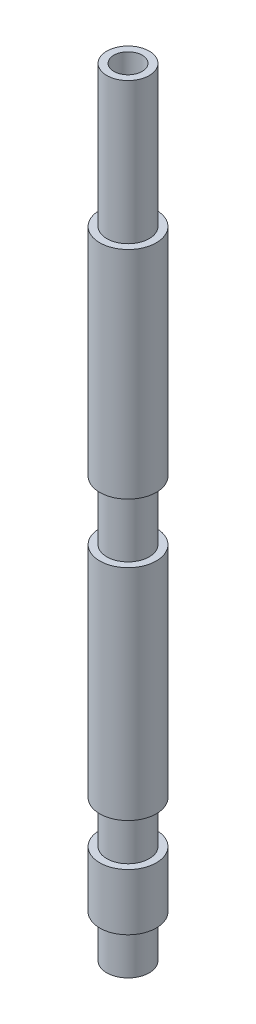
ISO-10303-21;
HEADER;
FILE_DESCRIPTION(('STEP AP214'),'2;1');
FILE_NAME('part.step','',(''),(''),'','','');
FILE_SCHEMA(('AUTOMOTIVE_DESIGN { 1 0 10303 214 1 1 1 1 }'));
ENDSEC;
DATA;
#1=APPLICATION_CONTEXT('core data for automotive mechanical design processes');
#2=APPLICATION_PROTOCOL_DEFINITION('international standard','automotive_design',2000,#1);
#3=PRODUCT_CONTEXT('',#1,'mechanical');
#4=PRODUCT('Part','Part','',(#3));
#5=PRODUCT_RELATED_PRODUCT_CATEGORY('part','',(#4));
#6=PRODUCT_DEFINITION_FORMATION('','',#4);
#7=PRODUCT_DEFINITION_CONTEXT('part definition',#1,'design');
#8=PRODUCT_DEFINITION('design','',#6,#7);
#9=PRODUCT_DEFINITION_SHAPE('','',#8);
#10=(LENGTH_UNIT() NAMED_UNIT(*) SI_UNIT(.MILLI.,.METRE.));
#11=(NAMED_UNIT(*) PLANE_ANGLE_UNIT() SI_UNIT($,.RADIAN.));
#12=(NAMED_UNIT(*) SI_UNIT($,.STERADIAN.) SOLID_ANGLE_UNIT());
#13=UNCERTAINTY_MEASURE_WITH_UNIT(LENGTH_MEASURE(1.E-05),#10,'distance_accuracy_value','');
#14=(GEOMETRIC_REPRESENTATION_CONTEXT(3) GLOBAL_UNCERTAINTY_ASSIGNED_CONTEXT((#13)) GLOBAL_UNIT_ASSIGNED_CONTEXT((#10,
#11,#12)) REPRESENTATION_CONTEXT('',''));
#15=CARTESIAN_POINT('',(0.,0.,0.));
#16=DIRECTION('',(0.,0.,1.));
#17=DIRECTION('',(1.,0.,0.));
#18=AXIS2_PLACEMENT_3D('',#15,#16,#17);
#19=CARTESIAN_POINT('',(0.,55.,0.));
#20=DIRECTION('',(0.,-1.,0.));
#21=DIRECTION('',(0.,0.,-1.));
#22=AXIS2_PLACEMENT_3D('',#19,#20,#21);
#23=CYLINDRICAL_SURFACE('',#22,2.);
#24=CARTESIAN_POINT('',(0.,45.,0.));
#25=DIRECTION('',(0.,-1.,0.));
#26=DIRECTION('',(0.,0.,-1.));
#27=AXIS2_PLACEMENT_3D('',#24,#25,#26);
#28=CIRCLE('',#27,2.);
#29=CARTESIAN_POINT('',(0.,45.,-2.));
#30=VERTEX_POINT('',#29);
#31=EDGE_CURVE('E66',#30,#30,#28,.T.);
#32=ORIENTED_EDGE('',*,*,#31,.T.);
#33=EDGE_LOOP('',(#32));
#34=FACE_BOUND('',#33,.T.);
#35=CARTESIAN_POINT('',(0.,29.7,0.));
#36=DIRECTION('',(0.,-1.,0.));
#37=DIRECTION('',(0.,0.,-1.));
#38=AXIS2_PLACEMENT_3D('',#35,#36,#37);
#39=CIRCLE('',#38,2.);
#40=CARTESIAN_POINT('',(0.,29.7,-2.));
#41=VERTEX_POINT('',#40);
#42=EDGE_CURVE('E75',#41,#41,#39,.T.);
#43=ORIENTED_EDGE('',*,*,#42,.F.);
#44=EDGE_LOOP('',(#43));
#45=FACE_BOUND('',#44,.T.);
#46=ADVANCED_FACE('F33',(#34,#45),#23,.T.);
#47=CARTESIAN_POINT('',(0.,10.,0.));
#48=DIRECTION('',(0.,-1.,0.));
#49=DIRECTION('',(0.,0.,-1.));
#50=AXIS2_PLACEMENT_3D('',#47,#48,#49);
#51=CIRCLE('',#50,2.);
#52=CARTESIAN_POINT('',(0.,10.,-2.));
#53=VERTEX_POINT('',#52);
#54=EDGE_CURVE('E54',#53,#53,#51,.T.);
#55=ORIENTED_EDGE('',*,*,#54,.F.);
#56=EDGE_LOOP('',(#55));
#57=FACE_BOUND('',#56,.T.);
#58=CARTESIAN_POINT('',(0.,25.5,0.));
#59=DIRECTION('',(0.,-1.,0.));
#60=DIRECTION('',(0.,0.,-1.));
#61=AXIS2_PLACEMENT_3D('',#58,#59,#60);
#62=CIRCLE('',#61,2.);
#63=CARTESIAN_POINT('',(0.,25.5,-2.));
#64=VERTEX_POINT('',#63);
#65=EDGE_CURVE('E84',#64,#64,#62,.T.);
#66=ORIENTED_EDGE('',*,*,#65,.T.);
#67=EDGE_LOOP('',(#66));
#68=FACE_BOUND('',#67,.T.);
#69=ADVANCED_FACE('F88',(#57,#68),#23,.T.);
#70=CARTESIAN_POINT('',(0.,55.,0.));
#71=DIRECTION('',(0.,1.,0.));
#72=DIRECTION('',(0.,0.,1.));
#73=AXIS2_PLACEMENT_3D('',#70,#71,#72);
#74=PLANE('',#73);
#75=CARTESIAN_POINT('',(0.,55.,0.));
#76=DIRECTION('',(0.,1.,0.));
#77=DIRECTION('',(0.,0.,1.));
#78=AXIS2_PLACEMENT_3D('',#75,#76,#77);
#79=CIRCLE('',#78,1.);
#80=CARTESIAN_POINT('',(0.,55.,1.));
#81=VERTEX_POINT('',#80);
#82=EDGE_CURVE('E10',#81,#81,#79,.T.);
#83=ORIENTED_EDGE('',*,*,#82,.F.);
#84=EDGE_LOOP('',(#83));
#85=FACE_BOUND('',#84,.T.);
#86=CARTESIAN_POINT('',(0.,55.,0.));
#87=DIRECTION('',(0.,-1.,0.));
#88=DIRECTION('',(0.,0.,-1.));
#89=AXIS2_PLACEMENT_3D('',#86,#87,#88);
#90=CIRCLE('',#89,1.5);
#91=CARTESIAN_POINT('',(0.,55.,-1.5));
#92=VERTEX_POINT('',#91);
#93=EDGE_CURVE('E72',#92,#92,#90,.T.);
#94=ORIENTED_EDGE('',*,*,#93,.F.);
#95=EDGE_LOOP('',(#94));
#96=FACE_BOUND('',#95,.T.);
#97=ADVANCED_FACE('F106',(#85,#96),#74,.T.);
#98=CARTESIAN_POINT('',(0.,0.,0.));
#99=DIRECTION('',(0.,1.,0.));
#100=DIRECTION('',(0.,0.,1.));
#101=AXIS2_PLACEMENT_3D('',#98,#99,#100);
#102=PLANE('',#101);
#103=CARTESIAN_POINT('',(0.,0.,0.));
#104=DIRECTION('',(0.,-1.,0.));
#105=DIRECTION('',(0.,0.,-1.));
#106=AXIS2_PLACEMENT_3D('',#103,#104,#105);
#107=CIRCLE('',#106,1.5);
#108=CARTESIAN_POINT('',(0.,0.,-1.5));
#109=VERTEX_POINT('',#108);
#110=EDGE_CURVE('E51',#109,#109,#107,.T.);
#111=ORIENTED_EDGE('',*,*,#110,.T.);
#112=EDGE_LOOP('',(#111));
#113=FACE_BOUND('',#112,.T.);
#114=CARTESIAN_POINT('',(0.,0.,0.));
#115=DIRECTION('',(0.,1.,0.));
#116=DIRECTION('',(0.,0.,1.));
#117=AXIS2_PLACEMENT_3D('',#114,#115,#116);
#118=CIRCLE('',#117,1.);
#119=CARTESIAN_POINT('',(0.,0.,1.));
#120=VERTEX_POINT('',#119);
#121=EDGE_CURVE('E37',#120,#120,#118,.T.);
#122=ORIENTED_EDGE('',*,*,#121,.T.);
#123=EDGE_LOOP('',(#122));
#124=FACE_BOUND('',#123,.T.);
#125=ADVANCED_FACE('F111',(#113,#124),#102,.F.);
#126=CARTESIAN_POINT('',(0.,7.,0.));
#127=DIRECTION('',(0.,-1.,0.));
#128=DIRECTION('',(0.,0.,-1.));
#129=AXIS2_PLACEMENT_3D('',#126,#127,#128);
#130=CIRCLE('',#129,2.);
#131=CARTESIAN_POINT('',(0.,7.,-2.));
#132=VERTEX_POINT('',#131);
#133=EDGE_CURVE('E63',#132,#132,#130,.T.);
#134=ORIENTED_EDGE('',*,*,#133,.T.);
#135=EDGE_LOOP('',(#134));
#136=FACE_BOUND('',#135,.T.);
#137=CARTESIAN_POINT('',(0.,3.,0.));
#138=DIRECTION('',(0.,-1.,0.));
#139=DIRECTION('',(0.,0.,-1.));
#140=AXIS2_PLACEMENT_3D('',#137,#138,#139);
#141=CIRCLE('',#140,2.);
#142=CARTESIAN_POINT('',(0.,3.,-2.));
#143=VERTEX_POINT('',#142);
#144=EDGE_CURVE('E48',#143,#143,#141,.T.);
#145=ORIENTED_EDGE('',*,*,#144,.F.);
#146=EDGE_LOOP('',(#145));
#147=FACE_BOUND('',#146,.T.);
#148=ADVANCED_FACE('F35',(#136,#147),#23,.T.);
#149=CARTESIAN_POINT('',(0.,55.,0.));
#150=DIRECTION('',(0.,-1.,0.));
#151=DIRECTION('',(0.,0.,-1.));
#152=AXIS2_PLACEMENT_3D('',#149,#150,#151);
#153=CYLINDRICAL_SURFACE('',#152,1.);
#154=ORIENTED_EDGE('',*,*,#82,.T.);
#155=EDGE_LOOP('',(#154));
#156=FACE_BOUND('',#155,.T.);
#157=ORIENTED_EDGE('',*,*,#121,.F.);
#158=EDGE_LOOP('',(#157));
#159=FACE_BOUND('',#158,.T.);
#160=ADVANCED_FACE('F110',(#156,#159),#153,.F.);
#161=CARTESIAN_POINT('',(0.,0.,0.));
#162=DIRECTION('',(0.,-1.,0.));
#163=DIRECTION('',(0.,0.,-1.));
#164=AXIS2_PLACEMENT_3D('',#161,#162,#163);
#165=CYLINDRICAL_SURFACE('',#164,1.5);
#166=ORIENTED_EDGE('',*,*,#110,.F.);
#167=EDGE_LOOP('',(#166));
#168=FACE_BOUND('',#167,.T.);
#169=CARTESIAN_POINT('',(0.,3.,0.));
#170=DIRECTION('',(0.,-1.,0.));
#171=DIRECTION('',(0.,0.,-1.));
#172=AXIS2_PLACEMENT_3D('',#169,#170,#171);
#173=CIRCLE('',#172,1.5);
#174=CARTESIAN_POINT('',(0.,3.,-1.5));
#175=VERTEX_POINT('',#174);
#176=EDGE_CURVE('E44',#175,#175,#173,.T.);
#177=ORIENTED_EDGE('',*,*,#176,.T.);
#178=EDGE_LOOP('',(#177));
#179=FACE_BOUND('',#178,.T.);
#180=ADVANCED_FACE('F117',(#168,#179),#165,.T.);
#181=CARTESIAN_POINT('',(1.5,3.,0.));
#182=DIRECTION('',(0.,1.,0.));
#183=DIRECTION('',(0.,0.,1.));
#184=AXIS2_PLACEMENT_3D('',#181,#182,#183);
#185=PLANE('',#184);
#186=ORIENTED_EDGE('',*,*,#176,.F.);
#187=EDGE_LOOP('',(#186));
#188=FACE_BOUND('',#187,.T.);
#189=ORIENTED_EDGE('',*,*,#144,.T.);
#190=EDGE_LOOP('',(#189));
#191=FACE_BOUND('',#190,.T.);
#192=ADVANCED_FACE('F124',(#188,#191),#185,.F.);
#193=CARTESIAN_POINT('',(2.,10.,0.));
#194=DIRECTION('',(0.,1.,0.));
#195=DIRECTION('',(0.,0.,1.));
#196=AXIS2_PLACEMENT_3D('',#193,#194,#195);
#197=PLANE('',#196);
#198=CARTESIAN_POINT('',(0.,10.,0.));
#199=DIRECTION('',(0.,-1.,0.));
#200=DIRECTION('',(0.,0.,-1.));
#201=AXIS2_PLACEMENT_3D('',#198,#199,#200);
#202=CIRCLE('',#201,1.5);
#203=CARTESIAN_POINT('',(0.,10.,-1.5));
#204=VERTEX_POINT('',#203);
#205=EDGE_CURVE('E57',#204,#204,#202,.T.);
#206=ORIENTED_EDGE('',*,*,#205,.F.);
#207=EDGE_LOOP('',(#206));
#208=FACE_BOUND('',#207,.T.);
#209=ORIENTED_EDGE('',*,*,#54,.T.);
#210=EDGE_LOOP('',(#209));
#211=FACE_BOUND('',#210,.T.);
#212=ADVANCED_FACE('F126',(#208,#211),#197,.F.);
#213=CARTESIAN_POINT('',(0.,0.,0.));
#214=DIRECTION('',(0.,-1.,0.));
#215=DIRECTION('',(0.,0.,-1.));
#216=AXIS2_PLACEMENT_3D('',#213,#214,#215);
#217=CYLINDRICAL_SURFACE('',#216,1.5);
#218=CARTESIAN_POINT('',(0.,7.,0.));
#219=DIRECTION('',(0.,-1.,0.));
#220=DIRECTION('',(0.,0.,-1.));
#221=AXIS2_PLACEMENT_3D('',#218,#219,#220);
#222=CIRCLE('',#221,1.5);
#223=CARTESIAN_POINT('',(0.,7.,-1.5));
#224=VERTEX_POINT('',#223);
#225=EDGE_CURVE('E60',#224,#224,#222,.T.);
#226=ORIENTED_EDGE('',*,*,#225,.F.);
#227=EDGE_LOOP('',(#226));
#228=FACE_BOUND('',#227,.T.);
#229=ORIENTED_EDGE('',*,*,#205,.T.);
#230=EDGE_LOOP('',(#229));
#231=FACE_BOUND('',#230,.T.);
#232=ADVANCED_FACE('F133',(#228,#231),#217,.T.);
#233=CARTESIAN_POINT('',(2.,7.,0.));
#234=DIRECTION('',(0.,-1.,0.));
#235=DIRECTION('',(0.,0.,-1.));
#236=AXIS2_PLACEMENT_3D('',#233,#234,#235);
#237=PLANE('',#236);
#238=ORIENTED_EDGE('',*,*,#133,.F.);
#239=EDGE_LOOP('',(#238));
#240=FACE_BOUND('',#239,.T.);
#241=ORIENTED_EDGE('',*,*,#225,.T.);
#242=EDGE_LOOP('',(#241));
#243=FACE_BOUND('',#242,.T.);
#244=ADVANCED_FACE('F159',(#240,#243),#237,.F.);
#245=CARTESIAN_POINT('',(2.,45.,0.));
#246=DIRECTION('',(0.,-1.,0.));
#247=DIRECTION('',(0.,0.,-1.));
#248=AXIS2_PLACEMENT_3D('',#245,#246,#247);
#249=PLANE('',#248);
#250=ORIENTED_EDGE('',*,*,#31,.F.);
#251=EDGE_LOOP('',(#250));
#252=FACE_BOUND('',#251,.T.);
#253=CARTESIAN_POINT('',(0.,45.,0.));
#254=DIRECTION('',(0.,-1.,0.));
#255=DIRECTION('',(0.,0.,-1.));
#256=AXIS2_PLACEMENT_3D('',#253,#254,#255);
#257=CIRCLE('',#256,1.5);
#258=CARTESIAN_POINT('',(0.,45.,-1.5));
#259=VERTEX_POINT('',#258);
#260=EDGE_CURVE('E69',#259,#259,#257,.T.);
#261=ORIENTED_EDGE('',*,*,#260,.T.);
#262=EDGE_LOOP('',(#261));
#263=FACE_BOUND('',#262,.T.);
#264=ADVANCED_FACE('F150',(#252,#263),#249,.F.);
#265=CARTESIAN_POINT('',(0.,0.,0.));
#266=DIRECTION('',(0.,-1.,0.));
#267=DIRECTION('',(0.,0.,-1.));
#268=AXIS2_PLACEMENT_3D('',#265,#266,#267);
#269=CYLINDRICAL_SURFACE('',#268,1.5);
#270=ORIENTED_EDGE('',*,*,#260,.F.);
#271=EDGE_LOOP('',(#270));
#272=FACE_BOUND('',#271,.T.);
#273=ORIENTED_EDGE('',*,*,#93,.T.);
#274=EDGE_LOOP('',(#273));
#275=FACE_BOUND('',#274,.T.);
#276=ADVANCED_FACE('F148',(#272,#275),#269,.T.);
#277=CARTESIAN_POINT('',(-2.,29.7,0.));
#278=DIRECTION('',(0.,-1.,0.));
#279=DIRECTION('',(0.,0.,-1.));
#280=AXIS2_PLACEMENT_3D('',#277,#278,#279);
#281=PLANE('',#280);
#282=ORIENTED_EDGE('',*,*,#42,.T.);
#283=EDGE_LOOP('',(#282));
#284=FACE_BOUND('',#283,.T.);
#285=CARTESIAN_POINT('',(0.,29.7,0.));
#286=DIRECTION('',(0.,-1.,0.));
#287=DIRECTION('',(0.,0.,-1.));
#288=AXIS2_PLACEMENT_3D('',#285,#286,#287);
#289=CIRCLE('',#288,1.5);
#290=CARTESIAN_POINT('',(0.,29.7,-1.5));
#291=VERTEX_POINT('',#290);
#292=EDGE_CURVE('E78',#291,#291,#289,.T.);
#293=ORIENTED_EDGE('',*,*,#292,.F.);
#294=EDGE_LOOP('',(#293));
#295=FACE_BOUND('',#294,.T.);
#296=ADVANCED_FACE('F98',(#284,#295),#281,.T.);
#297=CARTESIAN_POINT('',(0.,0.,0.));
#298=DIRECTION('',(0.,-1.,0.));
#299=DIRECTION('',(0.,0.,-1.));
#300=AXIS2_PLACEMENT_3D('',#297,#298,#299);
#301=CYLINDRICAL_SURFACE('',#300,1.5);
#302=ORIENTED_EDGE('',*,*,#292,.T.);
#303=EDGE_LOOP('',(#302));
#304=FACE_BOUND('',#303,.T.);
#305=CARTESIAN_POINT('',(0.,25.5,0.));
#306=DIRECTION('',(0.,-1.,0.));
#307=DIRECTION('',(0.,0.,-1.));
#308=AXIS2_PLACEMENT_3D('',#305,#306,#307);
#309=CIRCLE('',#308,1.5);
#310=CARTESIAN_POINT('',(0.,25.5,-1.5));
#311=VERTEX_POINT('',#310);
#312=EDGE_CURVE('E81',#311,#311,#309,.T.);
#313=ORIENTED_EDGE('',*,*,#312,.F.);
#314=EDGE_LOOP('',(#313));
#315=FACE_BOUND('',#314,.T.);
#316=ADVANCED_FACE('F92',(#304,#315),#301,.T.);
#317=CARTESIAN_POINT('',(-2.,25.5,0.));
#318=DIRECTION('',(0.,1.,0.));
#319=DIRECTION('',(0.,0.,1.));
#320=AXIS2_PLACEMENT_3D('',#317,#318,#319);
#321=PLANE('',#320);
#322=ORIENTED_EDGE('',*,*,#312,.T.);
#323=EDGE_LOOP('',(#322));
#324=FACE_BOUND('',#323,.T.);
#325=ORIENTED_EDGE('',*,*,#65,.F.);
#326=EDGE_LOOP('',(#325));
#327=FACE_BOUND('',#326,.T.);
#328=ADVANCED_FACE('F90',(#324,#327),#321,.T.);
#329=CLOSED_SHELL('',(#46,#69,#97,#125,#148,#160,#180,#192,#212,#232,#244,#264,#276,#296,#316,#328));
#330=MANIFOLD_SOLID_BREP('B2',#329);
#331=ADVANCED_BREP_SHAPE_REPRESENTATION('',(#18,#330),#14);
#332=SHAPE_DEFINITION_REPRESENTATION(#9,#331);
ENDSEC;
END-ISO-10303-21;
